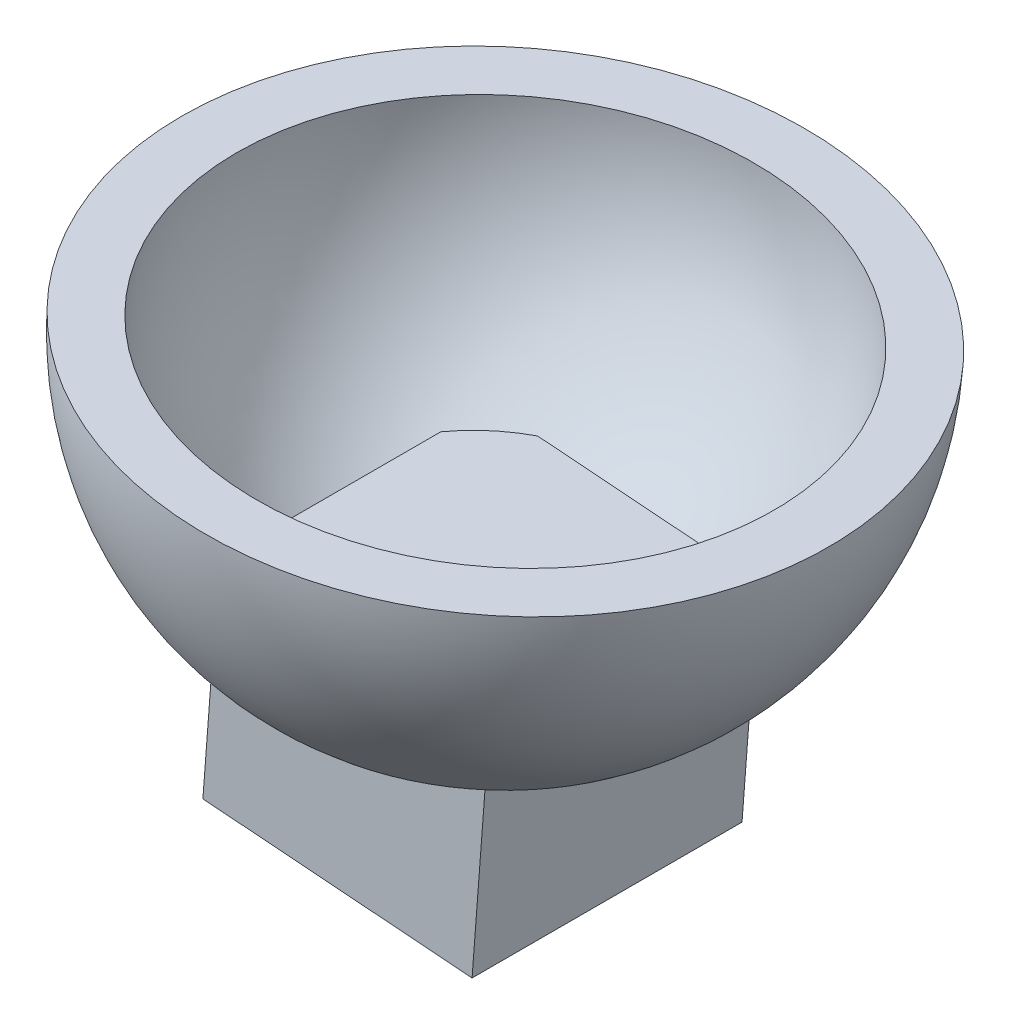
ISO-10303-21;
HEADER;
FILE_DESCRIPTION(('STEP AP214'),'2;1');
FILE_NAME('part.step','',(''),(''),'','','');
FILE_SCHEMA(('AUTOMOTIVE_DESIGN { 1 0 10303 214 1 1 1 1 }'));
ENDSEC;
DATA;
#1=APPLICATION_CONTEXT('core data for automotive mechanical design processes');
#2=APPLICATION_PROTOCOL_DEFINITION('international standard','automotive_design',2000,#1);
#3=PRODUCT_CONTEXT('',#1,'mechanical');
#4=PRODUCT('Part','Part','',(#3));
#5=PRODUCT_RELATED_PRODUCT_CATEGORY('part','',(#4));
#6=PRODUCT_DEFINITION_FORMATION('','',#4);
#7=PRODUCT_DEFINITION_CONTEXT('part definition',#1,'design');
#8=PRODUCT_DEFINITION('design','',#6,#7);
#9=PRODUCT_DEFINITION_SHAPE('','',#8);
#10=(LENGTH_UNIT() NAMED_UNIT(*) SI_UNIT(.MILLI.,.METRE.));
#11=(NAMED_UNIT(*) PLANE_ANGLE_UNIT() SI_UNIT($,.RADIAN.));
#12=(NAMED_UNIT(*) SI_UNIT($,.STERADIAN.) SOLID_ANGLE_UNIT());
#13=UNCERTAINTY_MEASURE_WITH_UNIT(LENGTH_MEASURE(1.E-05),#10,'distance_accuracy_value','');
#14=(GEOMETRIC_REPRESENTATION_CONTEXT(3) GLOBAL_UNCERTAINTY_ASSIGNED_CONTEXT((#13)) GLOBAL_UNIT_ASSIGNED_CONTEXT((#10,
#11,#12)) REPRESENTATION_CONTEXT('',''));
#15=CARTESIAN_POINT('',(0.,0.,0.));
#16=DIRECTION('',(0.,0.,1.));
#17=DIRECTION('',(1.,0.,0.));
#18=AXIS2_PLACEMENT_3D('',#15,#16,#17);
#19=CARTESIAN_POINT('',(0.,0.,0.));
#20=DIRECTION('',(0.0760336250845228,0.997105254151489,0.));
#21=DIRECTION('',(-0.997105254151489,0.0760336250845228,0.));
#22=AXIS2_PLACEMENT_3D('',#19,#20,#21);
#23=SPHERICAL_SURFACE('',#22,63.3855187269557);
#24=CARTESIAN_POINT('',(0.,0.,0.));
#25=DIRECTION('',(0.0760336250845228,0.997105254151489,0.));
#26=DIRECTION('',(-0.997105254151489,0.0760336250845228,0.));
#27=AXIS2_PLACEMENT_3D('',#24,#25,#26);
#28=CIRCLE('',#27,63.3855187269557);
#29=CARTESIAN_POINT('',(-63.2020337597652,4.81943076667335,0.));
#30=VERTEX_POINT('',#29);
#31=EDGE_CURVE('E175',#30,#30,#28,.T.);
#32=ORIENTED_EDGE('',*,*,#31,.T.);
#33=EDGE_LOOP('',(#32));
#34=FACE_BOUND('',#33,.T.);
#35=CARTESIAN_POINT('',(0.,0.,31.75));
#36=DIRECTION('',(0.,0.,1.));
#37=DIRECTION('',(1.,0.,0.));
#38=AXIS2_PLACEMENT_3D('',#35,#36,#37);
#39=CIRCLE('',#38,54.860381736598);
#40=CARTESIAN_POINT('',(-24.169030295648,-49.2495630321052,31.75));
#41=VERTEX_POINT('',#40);
#42=CARTESIAN_POINT('',(16.4220163869251,-52.3448074031495,31.75));
#43=VERTEX_POINT('',#42);
#44=EDGE_CURVE('E154',#41,#43,#39,.T.);
#45=ORIENTED_EDGE('',*,*,#44,.F.);
#46=CARTESIAN_POINT('',(-3.87350695436146,-50.7971852176274,0.));
#47=DIRECTION('',(-0.0760336250845229,-0.99710525415149,0.));
#48=DIRECTION('',(0.997105254151489,-0.0760336250845229,0.));
#49=AXIS2_PLACEMENT_3D('',#46,#47,#48);
#50=CIRCLE('',#49,37.7142665595638);
#51=CARTESIAN_POINT('',(-35.5315987736713,-48.3831176211938,20.3544442843775));
#52=VERTEX_POINT('',#51);
#53=EDGE_CURVE('E11',#41,#52,#50,.T.);
#54=ORIENTED_EDGE('',*,*,#53,.T.);
#55=CARTESIAN_POINT('',(-31.6580918193098,2.4140675964336,0.));
#56=DIRECTION('',(-0.997105254151489,0.0760336250845227,0.));
#57=DIRECTION('',(-0.0760336250845227,-0.997105254151489,0.));
#58=AXIS2_PLACEMENT_3D('',#55,#56,#57);
#59=CIRCLE('',#58,54.860381736598);
#60=CARTESIAN_POINT('',(-35.5315987736713,-48.3831176211938,-20.3544442843775));
#61=VERTEX_POINT('',#60);
#62=EDGE_CURVE('E162',#61,#52,#59,.T.);
#63=ORIENTED_EDGE('',*,*,#62,.F.);
#64=CARTESIAN_POINT('',(-24.169030295648,-49.2495630321052,-31.75));
#65=VERTEX_POINT('',#64);
#66=EDGE_CURVE('E191',#61,#65,#50,.T.);
#67=ORIENTED_EDGE('',*,*,#66,.T.);
#68=CARTESIAN_POINT('',(0.,0.,-31.75));
#69=DIRECTION('',(0.,0.,-1.));
#70=DIRECTION('',(-1.,0.,0.));
#71=AXIS2_PLACEMENT_3D('',#68,#69,#70);
#72=CIRCLE('',#71,54.860381736598);
#73=CARTESIAN_POINT('',(16.4220163869251,-52.3448074031495,-31.75));
#74=VERTEX_POINT('',#73);
#75=EDGE_CURVE('E165',#74,#65,#72,.T.);
#76=ORIENTED_EDGE('',*,*,#75,.F.);
#77=CARTESIAN_POINT('',(27.7845848649483,-53.211252814061,-20.3544442843775));
#78=VERTEX_POINT('',#77);
#79=EDGE_CURVE('E42',#74,#78,#50,.T.);
#80=ORIENTED_EDGE('',*,*,#79,.T.);
#81=CARTESIAN_POINT('',(31.6580918193098,-2.4140675964336,0.));
#82=DIRECTION('',(0.997105254151489,-0.0760336250845227,0.));
#83=DIRECTION('',(0.0760336250845227,0.997105254151489,0.));
#84=AXIS2_PLACEMENT_3D('',#81,#82,#83);
#85=CIRCLE('',#84,54.860381736598);
#86=CARTESIAN_POINT('',(27.7845848649483,-53.211252814061,20.3544442843775));
#87=VERTEX_POINT('',#86);
#88=EDGE_CURVE('E168',#87,#78,#85,.T.);
#89=ORIENTED_EDGE('',*,*,#88,.F.);
#90=EDGE_CURVE('E48',#87,#43,#50,.T.);
#91=ORIENTED_EDGE('',*,*,#90,.T.);
#92=EDGE_LOOP('',(#45,#54,#63,#67,#76,#80,#89,#91));
#93=FACE_BOUND('',#92,.T.);
#94=ADVANCED_FACE('F39',(#34,#93),#23,.F.);
#95=CARTESIAN_POINT('',(-76.1236586730751,5.80476103150833,0.));
#96=DIRECTION('',(0.0760336250845228,0.997105254151489,0.));
#97=DIRECTION('',(-0.997105254151489,0.0760336250845228,0.));
#98=AXIS2_PLACEMENT_3D('',#95,#96,#97);
#99=PLANE('',#98);
#100=CARTESIAN_POINT('',(0.,0.,0.));
#101=DIRECTION('',(0.0760336250845228,0.997105254151489,0.));
#102=DIRECTION('',(-0.997105254151489,0.0760336250845228,0.));
#103=AXIS2_PLACEMENT_3D('',#100,#101,#102);
#104=CIRCLE('',#103,76.3446570521328);
#105=CARTESIAN_POINT('',(-76.1236586730752,5.80476103150833,0.));
#106=VERTEX_POINT('',#105);
#107=EDGE_CURVE('E171',#106,#106,#104,.T.);
#108=ORIENTED_EDGE('',*,*,#107,.T.);
#109=EDGE_LOOP('',(#108));
#110=FACE_BOUND('',#109,.T.);
#111=ORIENTED_EDGE('',*,*,#31,.F.);
#112=EDGE_LOOP('',(#111));
#113=FACE_BOUND('',#112,.T.);
#114=ADVANCED_FACE('F221',(#110,#113),#99,.T.);
#115=CARTESIAN_POINT('',(0.,0.,0.));
#116=DIRECTION('',(0.0760336250845228,0.997105254151489,0.));
#117=DIRECTION('',(-0.997105254151489,0.0760336250845228,0.));
#118=AXIS2_PLACEMENT_3D('',#115,#116,#117);
#119=SPHERICAL_SURFACE('',#118,76.3446570521328);
#120=CARTESIAN_POINT('',(31.6580918193098,-2.4140675964336,0.));
#121=DIRECTION('',(0.997105254151489,-0.0760336250845227,0.));
#122=DIRECTION('',(0.0760336250845227,0.997105254151489,0.));
#123=AXIS2_PLACEMENT_3D('',#120,#121,#122);
#124=CIRCLE('',#123,69.4294185515605);
#125=CARTESIAN_POINT('',(26.9634346526344,-63.9798198820603,-31.75));
#126=VERTEX_POINT('',#125);
#127=CARTESIAN_POINT('',(26.9634346526344,-63.9798198820603,31.75));
#128=VERTEX_POINT('',#127);
#129=EDGE_CURVE('E63',#126,#128,#124,.F.);
#130=ORIENTED_EDGE('',*,*,#129,.F.);
#131=CARTESIAN_POINT('',(0.,0.,-31.75));
#132=DIRECTION('',(0.,0.,-1.));
#133=DIRECTION('',(-1.,0.,0.));
#134=AXIS2_PLACEMENT_3D('',#131,#132,#133);
#135=CIRCLE('',#134,69.4294185515605);
#136=CARTESIAN_POINT('',(-36.3527489859852,-59.1516846891931,-31.75));
#137=VERTEX_POINT('',#136);
#138=EDGE_CURVE('E186',#137,#126,#135,.F.);
#139=ORIENTED_EDGE('',*,*,#138,.F.);
#140=CARTESIAN_POINT('',(-31.6580918193098,2.4140675964336,0.));
#141=DIRECTION('',(-0.997105254151489,0.0760336250845227,0.));
#142=DIRECTION('',(-0.0760336250845227,-0.997105254151489,0.));
#143=AXIS2_PLACEMENT_3D('',#140,#141,#142);
#144=CIRCLE('',#143,69.4294185515604);
#145=CARTESIAN_POINT('',(-36.3527489859852,-59.1516846891931,31.75));
#146=VERTEX_POINT('',#145);
#147=EDGE_CURVE('E182',#146,#137,#144,.F.);
#148=ORIENTED_EDGE('',*,*,#147,.F.);
#149=CARTESIAN_POINT('',(0.,0.,31.75));
#150=DIRECTION('',(0.,0.,1.));
#151=DIRECTION('',(1.,0.,0.));
#152=AXIS2_PLACEMENT_3D('',#149,#150,#151);
#153=CIRCLE('',#152,69.4294185515605);
#154=EDGE_CURVE('E179',#128,#146,#153,.F.);
#155=ORIENTED_EDGE('',*,*,#154,.F.);
#156=EDGE_LOOP('',(#130,#139,#148,#155));
#157=FACE_BOUND('',#156,.T.);
#158=ORIENTED_EDGE('',*,*,#107,.F.);
#159=EDGE_LOOP('',(#158));
#160=FACE_BOUND('',#159,.T.);
#161=ADVANCED_FACE('F226',(#157,#160),#119,.T.);
#162=CARTESIAN_POINT('',(-7.73601510865523,-101.450132128523,0.));
#163=DIRECTION('',(-0.0760336250845229,-0.99710525415149,0.));
#164=DIRECTION('',(0.997105254151489,-0.0760336250845229,0.));
#165=AXIS2_PLACEMENT_3D('',#162,#163,#164);
#166=PLANE('',#165);
#167=DIRECTION('',(0.,0.,1.));
#168=VECTOR('',#167,1.);
#169=CARTESIAN_POINT('',(23.9220767106546,-103.864199724957,31.75));
#170=LINE('',#169,#168);
#171=CARTESIAN_POINT('',(23.9220767106546,-103.864199724957,-31.75));
#172=VERTEX_POINT('',#171);
#173=CARTESIAN_POINT('',(23.9220767106546,-103.864199724957,31.75));
#174=VERTEX_POINT('',#173);
#175=EDGE_CURVE('E110',#172,#174,#170,.T.);
#176=ORIENTED_EDGE('',*,*,#175,.T.);
#177=DIRECTION('',(-0.997105254151489,0.0760336250845229,0.));
#178=VECTOR('',#177,1.);
#179=CARTESIAN_POINT('',(-39.394106927965,-99.0360645320894,31.75));
#180=LINE('',#179,#178);
#181=CARTESIAN_POINT('',(-39.394106927965,-99.0360645320894,31.75));
#182=VERTEX_POINT('',#181);
#183=EDGE_CURVE('E118',#174,#182,#180,.T.);
#184=ORIENTED_EDGE('',*,*,#183,.T.);
#185=DIRECTION('',(0.,0.,-1.));
#186=VECTOR('',#185,1.);
#187=CARTESIAN_POINT('',(-39.394106927965,-99.0360645320894,31.75));
#188=LINE('',#187,#186);
#189=CARTESIAN_POINT('',(-39.394106927965,-99.0360645320894,-31.75));
#190=VERTEX_POINT('',#189);
#191=EDGE_CURVE('E125',#182,#190,#188,.T.);
#192=ORIENTED_EDGE('',*,*,#191,.T.);
#193=DIRECTION('',(0.997105254151489,-0.0760336250845229,0.));
#194=VECTOR('',#193,1.);
#195=CARTESIAN_POINT('',(-39.394106927965,-99.0360645320894,-31.75));
#196=LINE('',#195,#194);
#197=EDGE_CURVE('E130',#190,#172,#196,.T.);
#198=ORIENTED_EDGE('',*,*,#197,.T.);
#199=EDGE_LOOP('',(#176,#184,#192,#198));
#200=FACE_BOUND('',#199,.T.);
#201=ADVANCED_FACE('F128',(#200),#166,.T.);
#202=CARTESIAN_POINT('',(-35.5315987736712,-48.3831176211937,31.75));
#203=DIRECTION('',(0.,0.,1.));
#204=DIRECTION('',(1.,0.,0.));
#205=AXIS2_PLACEMENT_3D('',#202,#203,#204);
#206=PLANE('',#205);
#207=DIRECTION('',(-0.0760336250845227,-0.997105254151489,0.));
#208=VECTOR('',#207,1.);
#209=CARTESIAN_POINT('',(27.7845848649483,-53.2112528140609,31.75));
#210=LINE('',#209,#208);
#211=EDGE_CURVE('E105',#128,#174,#210,.T.);
#212=ORIENTED_EDGE('',*,*,#211,.F.);
#213=ORIENTED_EDGE('',*,*,#154,.T.);
#214=DIRECTION('',(-0.0760336250845227,-0.997105254151489,0.));
#215=VECTOR('',#214,1.);
#216=CARTESIAN_POINT('',(-35.5315987736712,-48.3831176211937,31.75));
#217=LINE('',#216,#215);
#218=EDGE_CURVE('E114',#146,#182,#217,.T.);
#219=ORIENTED_EDGE('',*,*,#218,.T.);
#220=ORIENTED_EDGE('',*,*,#183,.F.);
#221=EDGE_LOOP('',(#212,#213,#219,#220));
#222=FACE_BOUND('',#221,.T.);
#223=ADVANCED_FACE('F119',(#222),#206,.T.);
#224=CARTESIAN_POINT('',(-35.5315987736712,-48.3831176211937,31.75));
#225=DIRECTION('',(-0.997105254151489,0.0760336250845227,0.));
#226=DIRECTION('',(-0.0760336250845227,-0.997105254151489,0.));
#227=AXIS2_PLACEMENT_3D('',#224,#225,#226);
#228=PLANE('',#227);
#229=ORIENTED_EDGE('',*,*,#218,.F.);
#230=ORIENTED_EDGE('',*,*,#147,.T.);
#231=DIRECTION('',(-0.0760336250845227,-0.997105254151489,0.));
#232=VECTOR('',#231,1.);
#233=CARTESIAN_POINT('',(-35.5315987736712,-48.3831176211937,-31.75));
#234=LINE('',#233,#232);
#235=EDGE_CURVE('E155',#137,#190,#234,.T.);
#236=ORIENTED_EDGE('',*,*,#235,.T.);
#237=ORIENTED_EDGE('',*,*,#191,.F.);
#238=EDGE_LOOP('',(#229,#230,#236,#237));
#239=FACE_BOUND('',#238,.T.);
#240=ADVANCED_FACE('F242',(#239),#228,.T.);
#241=CARTESIAN_POINT('',(-35.5315987736712,-48.3831176211937,-31.75));
#242=DIRECTION('',(0.,0.,-1.));
#243=DIRECTION('',(-1.,0.,0.));
#244=AXIS2_PLACEMENT_3D('',#241,#242,#243);
#245=PLANE('',#244);
#246=ORIENTED_EDGE('',*,*,#235,.F.);
#247=ORIENTED_EDGE('',*,*,#138,.T.);
#248=DIRECTION('',(-0.0760336250845227,-0.997105254151489,0.));
#249=VECTOR('',#248,1.);
#250=CARTESIAN_POINT('',(27.7845848649483,-53.2112528140609,-31.75));
#251=LINE('',#250,#249);
#252=EDGE_CURVE('E151',#126,#172,#251,.T.);
#253=ORIENTED_EDGE('',*,*,#252,.T.);
#254=ORIENTED_EDGE('',*,*,#197,.F.);
#255=EDGE_LOOP('',(#246,#247,#253,#254));
#256=FACE_BOUND('',#255,.T.);
#257=ADVANCED_FACE('F215',(#256),#245,.T.);
#258=CARTESIAN_POINT('',(27.7845848649483,-53.2112528140609,31.75));
#259=DIRECTION('',(0.997105254151489,-0.0760336250845227,0.));
#260=DIRECTION('',(0.0760336250845227,0.997105254151489,0.));
#261=AXIS2_PLACEMENT_3D('',#258,#259,#260);
#262=PLANE('',#261);
#263=ORIENTED_EDGE('',*,*,#252,.F.);
#264=ORIENTED_EDGE('',*,*,#129,.T.);
#265=ORIENTED_EDGE('',*,*,#211,.T.);
#266=ORIENTED_EDGE('',*,*,#175,.F.);
#267=EDGE_LOOP('',(#263,#264,#265,#266));
#268=FACE_BOUND('',#267,.T.);
#269=ADVANCED_FACE('F108',(#268),#262,.T.);
#270=CARTESIAN_POINT('',(-3.87350695436147,-50.7971852176274,0.));
#271=DIRECTION('',(-0.0760336250845229,-0.99710525415149,0.));
#272=DIRECTION('',(0.997105254151489,-0.0760336250845229,0.));
#273=AXIS2_PLACEMENT_3D('',#270,#271,#272);
#274=PLANE('',#273);
#275=ORIENTED_EDGE('',*,*,#90,.F.);
#276=DIRECTION('',(0.,0.,1.));
#277=VECTOR('',#276,1.);
#278=CARTESIAN_POINT('',(27.7845848649483,-53.2112528140609,31.75));
#279=LINE('',#278,#277);
#280=EDGE_CURVE('E55',#78,#87,#279,.T.);
#281=ORIENTED_EDGE('',*,*,#280,.F.);
#282=ORIENTED_EDGE('',*,*,#79,.F.);
#283=DIRECTION('',(0.997105254151489,-0.0760336250845229,0.));
#284=VECTOR('',#283,1.);
#285=CARTESIAN_POINT('',(-35.5315987736712,-48.3831176211937,-31.75));
#286=LINE('',#285,#284);
#287=EDGE_CURVE('E115',#65,#74,#286,.T.);
#288=ORIENTED_EDGE('',*,*,#287,.F.);
#289=ORIENTED_EDGE('',*,*,#66,.F.);
#290=DIRECTION('',(0.,0.,-1.));
#291=VECTOR('',#290,1.);
#292=CARTESIAN_POINT('',(-35.5315987736712,-48.3831176211937,31.75));
#293=LINE('',#292,#291);
#294=EDGE_CURVE('E144',#52,#61,#293,.T.);
#295=ORIENTED_EDGE('',*,*,#294,.F.);
#296=ORIENTED_EDGE('',*,*,#53,.F.);
#297=DIRECTION('',(-0.997105254151489,0.0760336250845229,0.));
#298=VECTOR('',#297,1.);
#299=CARTESIAN_POINT('',(-35.5315987736712,-48.3831176211937,31.75));
#300=LINE('',#299,#298);
#301=EDGE_CURVE('E140',#43,#41,#300,.T.);
#302=ORIENTED_EDGE('',*,*,#301,.F.);
#303=EDGE_LOOP('',(#275,#281,#282,#288,#289,#295,#296,#302));
#304=FACE_BOUND('',#303,.T.);
#305=ADVANCED_FACE('F202',(#304),#274,.F.);
#306=ORIENTED_EDGE('',*,*,#280,.T.);
#307=ORIENTED_EDGE('',*,*,#88,.T.);
#308=EDGE_LOOP('',(#306,#307));
#309=FACE_BOUND('',#308,.T.);
#310=ADVANCED_FACE('F204',(#309),#262,.T.);
#311=ORIENTED_EDGE('',*,*,#287,.T.);
#312=ORIENTED_EDGE('',*,*,#75,.T.);
#313=EDGE_LOOP('',(#311,#312));
#314=FACE_BOUND('',#313,.T.);
#315=ADVANCED_FACE('F206',(#314),#245,.T.);
#316=ORIENTED_EDGE('',*,*,#294,.T.);
#317=ORIENTED_EDGE('',*,*,#62,.T.);
#318=EDGE_LOOP('',(#316,#317));
#319=FACE_BOUND('',#318,.T.);
#320=ADVANCED_FACE('F212',(#319),#228,.T.);
#321=ORIENTED_EDGE('',*,*,#301,.T.);
#322=ORIENTED_EDGE('',*,*,#44,.T.);
#323=EDGE_LOOP('',(#321,#322));
#324=FACE_BOUND('',#323,.T.);
#325=ADVANCED_FACE('F243',(#324),#206,.T.);
#326=CLOSED_SHELL('',(#94,#114,#161,#201,#223,#240,#257,#269,#305,#310,#315,#320,#325));
#327=MANIFOLD_SOLID_BREP('B2',#326);
#328=ADVANCED_BREP_SHAPE_REPRESENTATION('',(#18,#327),#14);
#329=SHAPE_DEFINITION_REPRESENTATION(#9,#328);
ENDSEC;
END-ISO-10303-21;
